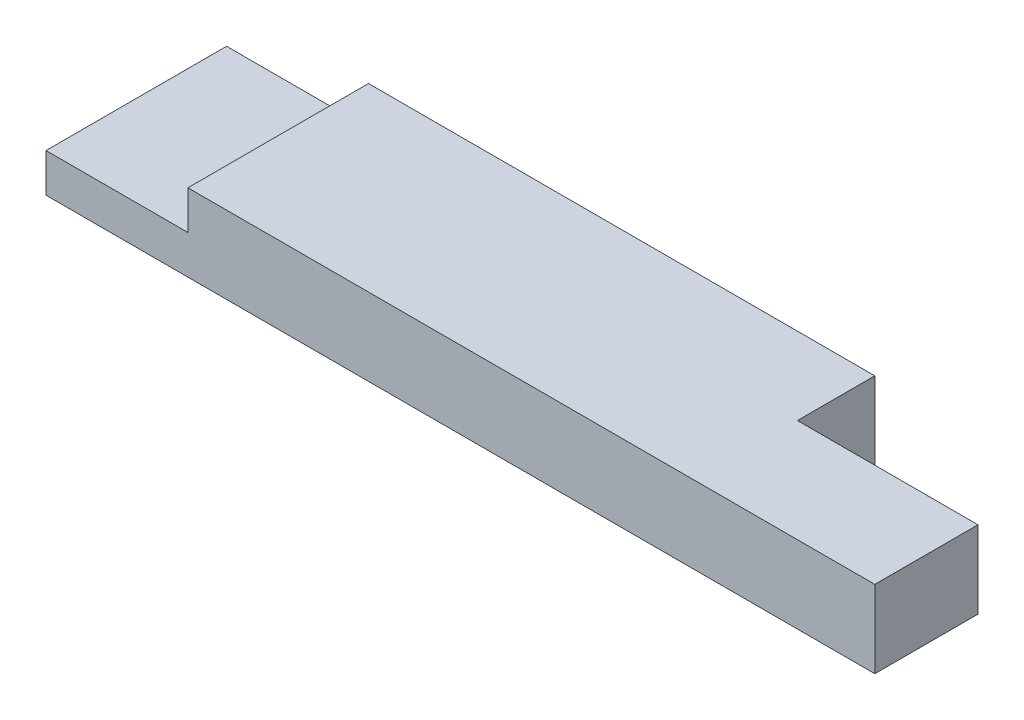
ISO-10303-21;
HEADER;
FILE_DESCRIPTION(('STEP AP214'),'2;1');
FILE_NAME('part.step','',(''),(''),'','','');
FILE_SCHEMA(('AUTOMOTIVE_DESIGN { 1 0 10303 214 1 1 1 1 }'));
ENDSEC;
DATA;
#1=APPLICATION_CONTEXT('core data for automotive mechanical design processes');
#2=APPLICATION_PROTOCOL_DEFINITION('international standard','automotive_design',2000,#1);
#3=PRODUCT_CONTEXT('',#1,'mechanical');
#4=PRODUCT('Part','Part','',(#3));
#5=PRODUCT_RELATED_PRODUCT_CATEGORY('part','',(#4));
#6=PRODUCT_DEFINITION_FORMATION('','',#4);
#7=PRODUCT_DEFINITION_CONTEXT('part definition',#1,'design');
#8=PRODUCT_DEFINITION('design','',#6,#7);
#9=PRODUCT_DEFINITION_SHAPE('','',#8);
#10=(LENGTH_UNIT() NAMED_UNIT(*) SI_UNIT(.MILLI.,.METRE.));
#11=(NAMED_UNIT(*) PLANE_ANGLE_UNIT() SI_UNIT($,.RADIAN.));
#12=(NAMED_UNIT(*) SI_UNIT($,.STERADIAN.) SOLID_ANGLE_UNIT());
#13=UNCERTAINTY_MEASURE_WITH_UNIT(LENGTH_MEASURE(1.E-05),#10,'distance_accuracy_value','');
#14=(GEOMETRIC_REPRESENTATION_CONTEXT(3) GLOBAL_UNCERTAINTY_ASSIGNED_CONTEXT((#13)) GLOBAL_UNIT_ASSIGNED_CONTEXT((#10,
#11,#12)) REPRESENTATION_CONTEXT('',''));
#15=CARTESIAN_POINT('',(0.,0.,0.));
#16=DIRECTION('',(0.,0.,1.));
#17=DIRECTION('',(1.,0.,0.));
#18=AXIS2_PLACEMENT_3D('',#15,#16,#17);
#19=CARTESIAN_POINT('',(0.,38.1,0.));
#20=DIRECTION('',(1.,0.,0.));
#21=DIRECTION('',(0.,0.,-1.));
#22=AXIS2_PLACEMENT_3D('',#19,#20,#21);
#23=PLANE('',#22);
#24=DIRECTION('',(0.,-1.,0.));
#25=VECTOR('',#24,1.);
#26=CARTESIAN_POINT('',(0.,38.1,0.));
#27=LINE('',#26,#25);
#28=CARTESIAN_POINT('',(0.,19.05,0.));
#29=VERTEX_POINT('',#28);
#30=CARTESIAN_POINT('',(0.,0.,0.));
#31=VERTEX_POINT('',#30);
#32=EDGE_CURVE('E11',#29,#31,#27,.T.);
#33=ORIENTED_EDGE('',*,*,#32,.F.);
#34=DIRECTION('',(0.,0.,-1.));
#35=VECTOR('',#34,1.);
#36=CARTESIAN_POINT('',(0.,19.05,0.));
#37=LINE('',#36,#35);
#38=CARTESIAN_POINT('',(0.,19.05,-88.9));
#39=VERTEX_POINT('',#38);
#40=EDGE_CURVE('E107',#29,#39,#37,.T.);
#41=ORIENTED_EDGE('',*,*,#40,.T.);
#42=DIRECTION('',(0.,-1.,0.));
#43=VECTOR('',#42,1.);
#44=CARTESIAN_POINT('',(0.,38.1,-88.9));
#45=LINE('',#44,#43);
#46=CARTESIAN_POINT('',(0.,0.,-88.9));
#47=VERTEX_POINT('',#46);
#48=EDGE_CURVE('E153',#39,#47,#45,.T.);
#49=ORIENTED_EDGE('',*,*,#48,.T.);
#50=DIRECTION('',(0.,0.,1.));
#51=VECTOR('',#50,1.);
#52=CARTESIAN_POINT('',(0.,0.,0.));
#53=LINE('',#52,#51);
#54=EDGE_CURVE('E141',#47,#31,#53,.T.);
#55=ORIENTED_EDGE('',*,*,#54,.T.);
#56=EDGE_LOOP('',(#33,#41,#49,#55));
#57=FACE_BOUND('',#56,.T.);
#58=ADVANCED_FACE('F39',(#57),#23,.F.);
#59=CARTESIAN_POINT('',(0.,38.1,0.));
#60=DIRECTION('',(0.,0.,-1.));
#61=DIRECTION('',(-1.,0.,0.));
#62=AXIS2_PLACEMENT_3D('',#59,#60,#61);
#63=PLANE('',#62);
#64=DIRECTION('',(1.,0.,0.));
#65=VECTOR('',#64,1.);
#66=CARTESIAN_POINT('',(0.,38.1,0.));
#67=LINE('',#66,#65);
#68=CARTESIAN_POINT('',(69.8499999999992,38.1,0.));
#69=VERTEX_POINT('',#68);
#70=CARTESIAN_POINT('',(407.9875,38.1,0.));
#71=VERTEX_POINT('',#70);
#72=EDGE_CURVE('E119',#69,#71,#67,.T.);
#73=ORIENTED_EDGE('',*,*,#72,.F.);
#74=DIRECTION('',(0.,-1.,0.));
#75=VECTOR('',#74,1.);
#76=CARTESIAN_POINT('',(69.8499999999992,38.0999999999991,0.));
#77=LINE('',#76,#75);
#78=CARTESIAN_POINT('',(69.8499999999992,19.05,0.));
#79=VERTEX_POINT('',#78);
#80=EDGE_CURVE('E53',#69,#79,#77,.T.);
#81=ORIENTED_EDGE('',*,*,#80,.T.);
#82=DIRECTION('',(-1.,0.,0.));
#83=VECTOR('',#82,1.);
#84=CARTESIAN_POINT('',(69.8499999999992,19.05,0.));
#85=LINE('',#84,#83);
#86=EDGE_CURVE('E108',#79,#29,#85,.T.);
#87=ORIENTED_EDGE('',*,*,#86,.T.);
#88=ORIENTED_EDGE('',*,*,#32,.T.);
#89=DIRECTION('',(1.,0.,0.));
#90=VECTOR('',#89,1.);
#91=CARTESIAN_POINT('',(0.,0.,0.));
#92=LINE('',#91,#90);
#93=CARTESIAN_POINT('',(407.9875,0.,0.));
#94=VERTEX_POINT('',#93);
#95=EDGE_CURVE('E156',#31,#94,#92,.T.);
#96=ORIENTED_EDGE('',*,*,#95,.T.);
#97=DIRECTION('',(0.,-1.,0.));
#98=VECTOR('',#97,1.);
#99=CARTESIAN_POINT('',(407.9875,38.1,0.));
#100=LINE('',#99,#98);
#101=EDGE_CURVE('E46',#71,#94,#100,.T.);
#102=ORIENTED_EDGE('',*,*,#101,.F.);
#103=EDGE_LOOP('',(#73,#81,#87,#88,#96,#102));
#104=FACE_BOUND('',#103,.T.);
#105=ADVANCED_FACE('F117',(#104),#63,.F.);
#106=CARTESIAN_POINT('',(407.9875,38.1,0.));
#107=DIRECTION('',(-1.,0.,0.));
#108=DIRECTION('',(0.,0.,1.));
#109=AXIS2_PLACEMENT_3D('',#106,#107,#108);
#110=PLANE('',#109);
#111=DIRECTION('',(0.,0.,-1.));
#112=VECTOR('',#111,1.);
#113=CARTESIAN_POINT('',(407.9875,0.,0.));
#114=LINE('',#113,#112);
#115=CARTESIAN_POINT('',(407.9875,0.,-50.8));
#116=VERTEX_POINT('',#115);
#117=EDGE_CURVE('E158',#94,#116,#114,.T.);
#118=ORIENTED_EDGE('',*,*,#117,.T.);
#119=DIRECTION('',(0.,1.,0.));
#120=VECTOR('',#119,1.);
#121=CARTESIAN_POINT('',(407.9875,0.,-50.8));
#122=LINE('',#121,#120);
#123=CARTESIAN_POINT('',(407.9875,38.1,-50.8));
#124=VERTEX_POINT('',#123);
#125=EDGE_CURVE('E138',#116,#124,#122,.T.);
#126=ORIENTED_EDGE('',*,*,#125,.T.);
#127=DIRECTION('',(0.,0.,-1.));
#128=VECTOR('',#127,1.);
#129=CARTESIAN_POINT('',(407.9875,38.1,0.));
#130=LINE('',#129,#128);
#131=EDGE_CURVE('E146',#71,#124,#130,.T.);
#132=ORIENTED_EDGE('',*,*,#131,.F.);
#133=ORIENTED_EDGE('',*,*,#101,.T.);
#134=EDGE_LOOP('',(#118,#126,#132,#133));
#135=FACE_BOUND('',#134,.T.);
#136=ADVANCED_FACE('F167',(#135),#110,.F.);
#137=CARTESIAN_POINT('',(0.,38.1,-88.9));
#138=DIRECTION('',(0.,0.,1.));
#139=DIRECTION('',(1.,0.,0.));
#140=AXIS2_PLACEMENT_3D('',#137,#138,#139);
#141=PLANE('',#140);
#142=DIRECTION('',(-1.,0.,0.));
#143=VECTOR('',#142,1.);
#144=CARTESIAN_POINT('',(69.8499999999992,19.05,-88.9));
#145=LINE('',#144,#143);
#146=CARTESIAN_POINT('',(69.8499999999992,19.05,-88.9));
#147=VERTEX_POINT('',#146);
#148=EDGE_CURVE('E120',#147,#39,#145,.T.);
#149=ORIENTED_EDGE('',*,*,#148,.F.);
#150=DIRECTION('',(0.,-1.,0.));
#151=VECTOR('',#150,1.);
#152=CARTESIAN_POINT('',(69.8499999999992,38.0999999999991,-88.9));
#153=LINE('',#152,#151);
#154=CARTESIAN_POINT('',(69.8499999999992,38.0999999999991,-88.9));
#155=VERTEX_POINT('',#154);
#156=EDGE_CURVE('E104',#155,#147,#153,.T.);
#157=ORIENTED_EDGE('',*,*,#156,.F.);
#158=DIRECTION('',(-1.,0.,0.));
#159=VECTOR('',#158,1.);
#160=CARTESIAN_POINT('',(0.,38.1,-88.9));
#161=LINE('',#160,#159);
#162=CARTESIAN_POINT('',(319.0875,38.1,-88.9));
#163=VERTEX_POINT('',#162);
#164=EDGE_CURVE('E150',#163,#155,#161,.T.);
#165=ORIENTED_EDGE('',*,*,#164,.F.);
#166=DIRECTION('',(0.,1.,0.));
#167=VECTOR('',#166,1.);
#168=CARTESIAN_POINT('',(319.0875,0.,-88.9));
#169=LINE('',#168,#167);
#170=CARTESIAN_POINT('',(319.0875,0.,-88.9));
#171=VERTEX_POINT('',#170);
#172=EDGE_CURVE('E134',#171,#163,#169,.T.);
#173=ORIENTED_EDGE('',*,*,#172,.F.);
#174=DIRECTION('',(-1.,0.,0.));
#175=VECTOR('',#174,1.);
#176=CARTESIAN_POINT('',(0.,0.,-88.9));
#177=LINE('',#176,#175);
#178=EDGE_CURVE('E147',#171,#47,#177,.T.);
#179=ORIENTED_EDGE('',*,*,#178,.T.);
#180=ORIENTED_EDGE('',*,*,#48,.F.);
#181=EDGE_LOOP('',(#149,#157,#165,#173,#179,#180));
#182=FACE_BOUND('',#181,.T.);
#183=ADVANCED_FACE('F179',(#182),#141,.F.);
#184=CARTESIAN_POINT('',(0.,38.1,0.));
#185=DIRECTION('',(0.,-1.,0.));
#186=DIRECTION('',(0.,0.,-1.));
#187=AXIS2_PLACEMENT_3D('',#184,#185,#186);
#188=PLANE('',#187);
#189=ORIENTED_EDGE('',*,*,#164,.T.);
#190=DIRECTION('',(0.,0.,-1.));
#191=VECTOR('',#190,1.);
#192=CARTESIAN_POINT('',(69.8499999999992,38.0999999999991,0.));
#193=LINE('',#192,#191);
#194=EDGE_CURVE('E125',#69,#155,#193,.T.);
#195=ORIENTED_EDGE('',*,*,#194,.F.);
#196=ORIENTED_EDGE('',*,*,#72,.T.);
#197=ORIENTED_EDGE('',*,*,#131,.T.);
#198=DIRECTION('',(1.,0.,0.));
#199=VECTOR('',#198,1.);
#200=CARTESIAN_POINT('',(407.9875,38.1,-50.8));
#201=LINE('',#200,#199);
#202=CARTESIAN_POINT('',(319.0875,38.1,-50.8));
#203=VERTEX_POINT('',#202);
#204=EDGE_CURVE('E132',#203,#124,#201,.T.);
#205=ORIENTED_EDGE('',*,*,#204,.F.);
#206=DIRECTION('',(0.,0.,1.));
#207=VECTOR('',#206,1.);
#208=CARTESIAN_POINT('',(319.0875,38.1,-88.9));
#209=LINE('',#208,#207);
#210=EDGE_CURVE('E127',#163,#203,#209,.T.);
#211=ORIENTED_EDGE('',*,*,#210,.F.);
#212=EDGE_LOOP('',(#189,#195,#196,#197,#205,#211));
#213=FACE_BOUND('',#212,.T.);
#214=ADVANCED_FACE('F182',(#213),#188,.F.);
#215=CARTESIAN_POINT('',(0.,0.,0.));
#216=DIRECTION('',(0.,-1.,0.));
#217=DIRECTION('',(0.,0.,-1.));
#218=AXIS2_PLACEMENT_3D('',#215,#216,#217);
#219=PLANE('',#218);
#220=DIRECTION('',(1.,0.,0.));
#221=VECTOR('',#220,1.);
#222=CARTESIAN_POINT('',(407.9875,0.,-50.8));
#223=LINE('',#222,#221);
#224=CARTESIAN_POINT('',(319.0875,0.,-50.8));
#225=VERTEX_POINT('',#224);
#226=EDGE_CURVE('E61',#225,#116,#223,.T.);
#227=ORIENTED_EDGE('',*,*,#226,.T.);
#228=ORIENTED_EDGE('',*,*,#117,.F.);
#229=ORIENTED_EDGE('',*,*,#95,.F.);
#230=ORIENTED_EDGE('',*,*,#54,.F.);
#231=ORIENTED_EDGE('',*,*,#178,.F.);
#232=DIRECTION('',(0.,0.,1.));
#233=VECTOR('',#232,1.);
#234=CARTESIAN_POINT('',(319.0875,0.,-88.9));
#235=LINE('',#234,#233);
#236=EDGE_CURVE('E129',#171,#225,#235,.T.);
#237=ORIENTED_EDGE('',*,*,#236,.T.);
#238=EDGE_LOOP('',(#227,#228,#229,#230,#231,#237));
#239=FACE_BOUND('',#238,.T.);
#240=ADVANCED_FACE('F170',(#239),#219,.T.);
#241=CARTESIAN_POINT('',(407.9875,0.,-50.8));
#242=DIRECTION('',(0.,0.,1.));
#243=DIRECTION('',(1.,0.,0.));
#244=AXIS2_PLACEMENT_3D('',#241,#242,#243);
#245=PLANE('',#244);
#246=ORIENTED_EDGE('',*,*,#204,.T.);
#247=ORIENTED_EDGE('',*,*,#125,.F.);
#248=ORIENTED_EDGE('',*,*,#226,.F.);
#249=DIRECTION('',(0.,1.,0.));
#250=VECTOR('',#249,1.);
#251=CARTESIAN_POINT('',(319.0875,0.,-50.8));
#252=LINE('',#251,#250);
#253=EDGE_CURVE('E142',#225,#203,#252,.T.);
#254=ORIENTED_EDGE('',*,*,#253,.T.);
#255=EDGE_LOOP('',(#246,#247,#248,#254));
#256=FACE_BOUND('',#255,.T.);
#257=ADVANCED_FACE('F184',(#256),#245,.F.);
#258=CARTESIAN_POINT('',(319.0875,0.,-88.9));
#259=DIRECTION('',(-1.,0.,0.));
#260=DIRECTION('',(0.,0.,1.));
#261=AXIS2_PLACEMENT_3D('',#258,#259,#260);
#262=PLANE('',#261);
#263=ORIENTED_EDGE('',*,*,#210,.T.);
#264=ORIENTED_EDGE('',*,*,#253,.F.);
#265=ORIENTED_EDGE('',*,*,#236,.F.);
#266=ORIENTED_EDGE('',*,*,#172,.T.);
#267=EDGE_LOOP('',(#263,#264,#265,#266));
#268=FACE_BOUND('',#267,.T.);
#269=ADVANCED_FACE('F175',(#268),#262,.F.);
#270=CARTESIAN_POINT('',(69.8499999999992,38.0999999999991,0.));
#271=DIRECTION('',(1.,0.,0.));
#272=DIRECTION('',(0.,0.,-1.));
#273=AXIS2_PLACEMENT_3D('',#270,#271,#272);
#274=PLANE('',#273);
#275=ORIENTED_EDGE('',*,*,#156,.T.);
#276=DIRECTION('',(0.,0.,-1.));
#277=VECTOR('',#276,1.);
#278=CARTESIAN_POINT('',(69.8499999999992,19.05,0.));
#279=LINE('',#278,#277);
#280=EDGE_CURVE('E100',#79,#147,#279,.T.);
#281=ORIENTED_EDGE('',*,*,#280,.F.);
#282=ORIENTED_EDGE('',*,*,#80,.F.);
#283=ORIENTED_EDGE('',*,*,#194,.T.);
#284=EDGE_LOOP('',(#275,#281,#282,#283));
#285=FACE_BOUND('',#284,.T.);
#286=ADVANCED_FACE('F102',(#285),#274,.F.);
#287=CARTESIAN_POINT('',(69.8499999999992,19.05,0.));
#288=DIRECTION('',(0.,-1.,0.));
#289=DIRECTION('',(0.,0.,-1.));
#290=AXIS2_PLACEMENT_3D('',#287,#288,#289);
#291=PLANE('',#290);
#292=ORIENTED_EDGE('',*,*,#148,.T.);
#293=ORIENTED_EDGE('',*,*,#40,.F.);
#294=ORIENTED_EDGE('',*,*,#86,.F.);
#295=ORIENTED_EDGE('',*,*,#280,.T.);
#296=EDGE_LOOP('',(#292,#293,#294,#295));
#297=FACE_BOUND('',#296,.T.);
#298=ADVANCED_FACE('F111',(#297),#291,.F.);
#299=CLOSED_SHELL('',(#58,#105,#136,#183,#214,#240,#257,#269,#286,#298));
#300=MANIFOLD_SOLID_BREP('B2',#299);
#301=ADVANCED_BREP_SHAPE_REPRESENTATION('',(#18,#300),#14);
#302=SHAPE_DEFINITION_REPRESENTATION(#9,#301);
ENDSEC;
END-ISO-10303-21;
